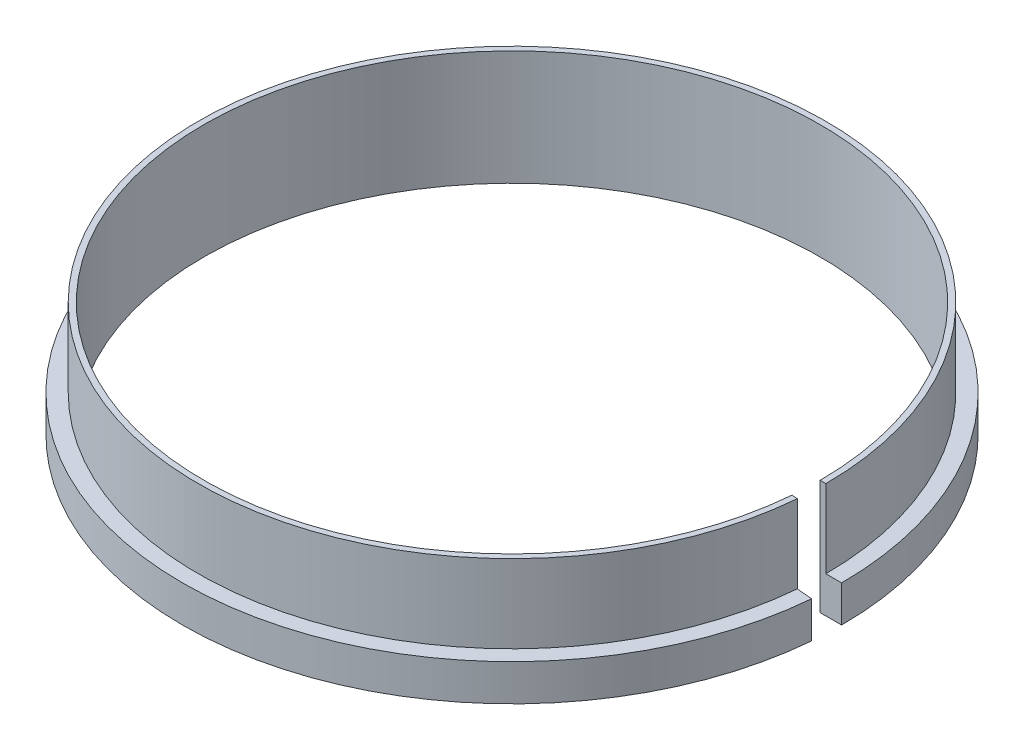
ISO-10303-21;
HEADER;
FILE_DESCRIPTION(('STEP AP214'),'2;1');
FILE_NAME('part.step','',(''),(''),'','','');
FILE_SCHEMA(('AUTOMOTIVE_DESIGN { 1 0 10303 214 1 1 1 1 }'));
ENDSEC;
DATA;
#1=APPLICATION_CONTEXT('core data for automotive mechanical design processes');
#2=APPLICATION_PROTOCOL_DEFINITION('international standard','automotive_design',2000,#1);
#3=PRODUCT_CONTEXT('',#1,'mechanical');
#4=PRODUCT('Part','Part','',(#3));
#5=PRODUCT_RELATED_PRODUCT_CATEGORY('part','',(#4));
#6=PRODUCT_DEFINITION_FORMATION('','',#4);
#7=PRODUCT_DEFINITION_CONTEXT('part definition',#1,'design');
#8=PRODUCT_DEFINITION('design','',#6,#7);
#9=PRODUCT_DEFINITION_SHAPE('','',#8);
#10=(LENGTH_UNIT() NAMED_UNIT(*) SI_UNIT(.MILLI.,.METRE.));
#11=(NAMED_UNIT(*) PLANE_ANGLE_UNIT() SI_UNIT($,.RADIAN.));
#12=(NAMED_UNIT(*) SI_UNIT($,.STERADIAN.) SOLID_ANGLE_UNIT());
#13=UNCERTAINTY_MEASURE_WITH_UNIT(LENGTH_MEASURE(1.E-05),#10,'distance_accuracy_value','');
#14=(GEOMETRIC_REPRESENTATION_CONTEXT(3) GLOBAL_UNCERTAINTY_ASSIGNED_CONTEXT((#13)) GLOBAL_UNIT_ASSIGNED_CONTEXT((#10,
#11,#12)) REPRESENTATION_CONTEXT('',''));
#15=CARTESIAN_POINT('',(0.,0.,0.));
#16=DIRECTION('',(0.,0.,1.));
#17=DIRECTION('',(1.,0.,0.));
#18=AXIS2_PLACEMENT_3D('',#15,#16,#17);
#19=CARTESIAN_POINT('',(22.9124780561102,0.,2.00458208319583));
#20=DIRECTION('',(0.,-1.,0.));
#21=DIRECTION('',(0.,0.,-1.));
#22=AXIS2_PLACEMENT_3D('',#19,#20,#21);
#23=PLANE('',#22);
#24=CARTESIAN_POINT('',(0.,0.,0.));
#25=DIRECTION('',(0.,-1.,0.));
#26=DIRECTION('',(0.,0.,-1.));
#27=AXIS2_PLACEMENT_3D('',#24,#25,#26);
#28=CIRCLE('',#27,21.5);
#29=CARTESIAN_POINT('',(21.4181860089726,0.,1.87384846907437));
#30=VERTEX_POINT('',#29);
#31=CARTESIAN_POINT('',(21.5,0.,0.));
#32=VERTEX_POINT('',#31);
#33=EDGE_CURVE('E13',#30,#32,#28,.T.);
#34=ORIENTED_EDGE('',*,*,#33,.F.);
#35=DIRECTION('',(0.996194698091749,0.,0.0871557427476454));
#36=VECTOR('',#35,1.);
#37=CARTESIAN_POINT('',(22.9124780561102,0.,2.00458208319583));
#38=LINE('',#37,#36);
#39=CARTESIAN_POINT('',(22.9124780561102,0.,2.00458208319583));
#40=VERTEX_POINT('',#39);
#41=EDGE_CURVE('E99',#30,#40,#38,.T.);
#42=ORIENTED_EDGE('',*,*,#41,.T.);
#43=CARTESIAN_POINT('',(0.,0.,0.));
#44=DIRECTION('',(0.,-1.,0.));
#45=DIRECTION('',(0.,0.,-1.));
#46=AXIS2_PLACEMENT_3D('',#43,#44,#45);
#47=CIRCLE('',#46,23.);
#48=CARTESIAN_POINT('',(23.,0.,0.));
#49=VERTEX_POINT('',#48);
#50=EDGE_CURVE('E94',#40,#49,#47,.T.);
#51=ORIENTED_EDGE('',*,*,#50,.T.);
#52=DIRECTION('',(1.,0.,0.));
#53=VECTOR('',#52,1.);
#54=CARTESIAN_POINT('',(23.,0.,0.));
#55=LINE('',#54,#53);
#56=EDGE_CURVE('E97',#32,#49,#55,.T.);
#57=ORIENTED_EDGE('',*,*,#56,.F.);
#58=EDGE_LOOP('',(#34,#42,#51,#57));
#59=FACE_BOUND('',#58,.T.);
#60=ADVANCED_FACE('F46',(#59),#23,.T.);
#61=CARTESIAN_POINT('',(0.,0.,0.));
#62=DIRECTION('',(0.,-1.,0.));
#63=DIRECTION('',(0.,0.,-1.));
#64=AXIS2_PLACEMENT_3D('',#61,#62,#63);
#65=CYLINDRICAL_SURFACE('',#64,21.5);
#66=CARTESIAN_POINT('',(0.,8.,0.));
#67=DIRECTION('',(0.,-1.,0.));
#68=DIRECTION('',(0.,0.,-1.));
#69=AXIS2_PLACEMENT_3D('',#66,#67,#68);
#70=CIRCLE('',#69,21.5);
#71=CARTESIAN_POINT('',(21.4181860089726,8.,1.87384846907437));
#72=VERTEX_POINT('',#71);
#73=CARTESIAN_POINT('',(21.5,8.,0.));
#74=VERTEX_POINT('',#73);
#75=EDGE_CURVE('E54',#72,#74,#70,.T.);
#76=ORIENTED_EDGE('',*,*,#75,.F.);
#77=DIRECTION('',(0.,-1.,0.));
#78=VECTOR('',#77,1.);
#79=CARTESIAN_POINT('',(21.4181860089726,0.,1.87384846907437));
#80=LINE('',#79,#78);
#81=EDGE_CURVE('E104',#72,#30,#80,.T.);
#82=ORIENTED_EDGE('',*,*,#81,.T.);
#83=ORIENTED_EDGE('',*,*,#33,.T.);
#84=DIRECTION('',(0.,-1.,0.));
#85=VECTOR('',#84,1.);
#86=CARTESIAN_POINT('',(21.5,0.,0.));
#87=LINE('',#86,#85);
#88=EDGE_CURVE('E117',#74,#32,#87,.T.);
#89=ORIENTED_EDGE('',*,*,#88,.F.);
#90=EDGE_LOOP('',(#76,#82,#83,#89));
#91=FACE_BOUND('',#90,.T.);
#92=ADVANCED_FACE('F48',(#91),#65,.F.);
#93=CARTESIAN_POINT('',(21.4181860089726,8.,1.87384846907437));
#94=DIRECTION('',(0.,1.,0.));
#95=DIRECTION('',(0.,0.,1.));
#96=AXIS2_PLACEMENT_3D('',#93,#94,#95);
#97=PLANE('',#96);
#98=CARTESIAN_POINT('',(0.,8.,0.));
#99=DIRECTION('',(0.,-1.,0.));
#100=DIRECTION('',(0.,0.,-1.));
#101=AXIS2_PLACEMENT_3D('',#98,#99,#100);
#102=CIRCLE('',#101,21.9);
#103=CARTESIAN_POINT('',(21.8166638882093,8.,1.90871076617341));
#104=VERTEX_POINT('',#103);
#105=CARTESIAN_POINT('',(21.9,8.,0.));
#106=VERTEX_POINT('',#105);
#107=EDGE_CURVE('E142',#104,#106,#102,.T.);
#108=ORIENTED_EDGE('',*,*,#107,.F.);
#109=DIRECTION('',(-0.996194698091749,0.,-0.0871557427476454));
#110=VECTOR('',#109,1.);
#111=CARTESIAN_POINT('',(21.4181860089726,8.,1.87384846907437));
#112=LINE('',#111,#110);
#113=EDGE_CURVE('E136',#104,#72,#112,.T.);
#114=ORIENTED_EDGE('',*,*,#113,.T.);
#115=ORIENTED_EDGE('',*,*,#75,.T.);
#116=DIRECTION('',(-1.,0.,0.));
#117=VECTOR('',#116,1.);
#118=CARTESIAN_POINT('',(21.5,8.,0.));
#119=LINE('',#118,#117);
#120=EDGE_CURVE('E124',#106,#74,#119,.T.);
#121=ORIENTED_EDGE('',*,*,#120,.F.);
#122=EDGE_LOOP('',(#108,#114,#115,#121));
#123=FACE_BOUND('',#122,.T.);
#124=ADVANCED_FACE('F145',(#123),#97,.T.);
#125=CARTESIAN_POINT('',(0.,0.,0.));
#126=DIRECTION('',(0.,-1.,0.));
#127=DIRECTION('',(0.,0.,-1.));
#128=AXIS2_PLACEMENT_3D('',#125,#126,#127);
#129=CYLINDRICAL_SURFACE('',#128,21.9);
#130=CARTESIAN_POINT('',(0.,2.55,0.));
#131=DIRECTION('',(0.,-1.,0.));
#132=DIRECTION('',(0.,0.,-1.));
#133=AXIS2_PLACEMENT_3D('',#130,#131,#132);
#134=CIRCLE('',#133,21.9);
#135=CARTESIAN_POINT('',(21.8166638882093,2.55,1.90871076617341));
#136=VERTEX_POINT('',#135);
#137=CARTESIAN_POINT('',(21.9,2.55,0.));
#138=VERTEX_POINT('',#137);
#139=EDGE_CURVE('E140',#136,#138,#134,.T.);
#140=ORIENTED_EDGE('',*,*,#139,.F.);
#141=DIRECTION('',(0.,1.,0.));
#142=VECTOR('',#141,1.);
#143=CARTESIAN_POINT('',(21.8166638882093,8.,1.90871076617341));
#144=LINE('',#143,#142);
#145=EDGE_CURVE('E133',#136,#104,#144,.T.);
#146=ORIENTED_EDGE('',*,*,#145,.T.);
#147=ORIENTED_EDGE('',*,*,#107,.T.);
#148=DIRECTION('',(0.,1.,0.));
#149=VECTOR('',#148,1.);
#150=CARTESIAN_POINT('',(21.9,8.,0.));
#151=LINE('',#150,#149);
#152=EDGE_CURVE('E121',#138,#106,#151,.T.);
#153=ORIENTED_EDGE('',*,*,#152,.F.);
#154=EDGE_LOOP('',(#140,#146,#147,#153));
#155=FACE_BOUND('',#154,.T.);
#156=ADVANCED_FACE('F156',(#155),#129,.T.);
#157=CARTESIAN_POINT('',(21.8166638882093,2.55,1.90871076617341));
#158=DIRECTION('',(0.,1.,0.));
#159=DIRECTION('',(0.,0.,1.));
#160=AXIS2_PLACEMENT_3D('',#157,#158,#159);
#161=PLANE('',#160);
#162=CARTESIAN_POINT('',(0.,2.55,0.));
#163=DIRECTION('',(0.,-1.,0.));
#164=DIRECTION('',(0.,0.,-1.));
#165=AXIS2_PLACEMENT_3D('',#162,#163,#164);
#166=CIRCLE('',#165,23.);
#167=CARTESIAN_POINT('',(22.9124780561102,2.55,2.00458208319583));
#168=VERTEX_POINT('',#167);
#169=CARTESIAN_POINT('',(23.,2.55,0.));
#170=VERTEX_POINT('',#169);
#171=EDGE_CURVE('E103',#168,#170,#166,.T.);
#172=ORIENTED_EDGE('',*,*,#171,.F.);
#173=DIRECTION('',(-0.996194698091749,0.,-0.0871557427476454));
#174=VECTOR('',#173,1.);
#175=CARTESIAN_POINT('',(21.8166638882093,2.55,1.90871076617341));
#176=LINE('',#175,#174);
#177=EDGE_CURVE('E130',#168,#136,#176,.T.);
#178=ORIENTED_EDGE('',*,*,#177,.T.);
#179=ORIENTED_EDGE('',*,*,#139,.T.);
#180=DIRECTION('',(-1.,0.,0.));
#181=VECTOR('',#180,1.);
#182=CARTESIAN_POINT('',(21.9,2.55,0.));
#183=LINE('',#182,#181);
#184=EDGE_CURVE('E112',#170,#138,#183,.T.);
#185=ORIENTED_EDGE('',*,*,#184,.F.);
#186=EDGE_LOOP('',(#172,#178,#179,#185));
#187=FACE_BOUND('',#186,.T.);
#188=ADVANCED_FACE('F154',(#187),#161,.T.);
#189=CARTESIAN_POINT('',(0.,0.,0.));
#190=DIRECTION('',(0.,-1.,0.));
#191=DIRECTION('',(0.,0.,-1.));
#192=AXIS2_PLACEMENT_3D('',#189,#190,#191);
#193=CYLINDRICAL_SURFACE('',#192,23.);
#194=DIRECTION('',(0.,1.,0.));
#195=VECTOR('',#194,1.);
#196=CARTESIAN_POINT('',(22.9124780561102,2.55,2.00458208319583));
#197=LINE('',#196,#195);
#198=EDGE_CURVE('E128',#40,#168,#197,.T.);
#199=ORIENTED_EDGE('',*,*,#198,.T.);
#200=ORIENTED_EDGE('',*,*,#171,.T.);
#201=DIRECTION('',(0.,1.,0.));
#202=VECTOR('',#201,1.);
#203=CARTESIAN_POINT('',(23.,2.55,0.));
#204=LINE('',#203,#202);
#205=EDGE_CURVE('E107',#49,#170,#204,.T.);
#206=ORIENTED_EDGE('',*,*,#205,.F.);
#207=ORIENTED_EDGE('',*,*,#50,.F.);
#208=EDGE_LOOP('',(#199,#200,#206,#207));
#209=FACE_BOUND('',#208,.T.);
#210=ADVANCED_FACE('F108',(#209),#193,.T.);
#211=CARTESIAN_POINT('',(0.,0.,0.));
#212=DIRECTION('',(0.0871557427476454,0.,-0.996194698091749));
#213=DIRECTION('',(-0.996194698091749,0.,-0.0871557427476454));
#214=AXIS2_PLACEMENT_3D('',#211,#212,#213);
#215=PLANE('',#214);
#216=ORIENTED_EDGE('',*,*,#41,.F.);
#217=ORIENTED_EDGE('',*,*,#81,.F.);
#218=ORIENTED_EDGE('',*,*,#113,.F.);
#219=ORIENTED_EDGE('',*,*,#145,.F.);
#220=ORIENTED_EDGE('',*,*,#177,.F.);
#221=ORIENTED_EDGE('',*,*,#198,.F.);
#222=EDGE_LOOP('',(#216,#217,#218,#219,#220,#221));
#223=FACE_BOUND('',#222,.T.);
#224=ADVANCED_FACE('F150',(#223),#215,.T.);
#225=CARTESIAN_POINT('',(0.,0.,0.));
#226=DIRECTION('',(0.,0.,-1.));
#227=DIRECTION('',(-1.,0.,0.));
#228=AXIS2_PLACEMENT_3D('',#225,#226,#227);
#229=PLANE('',#228);
#230=ORIENTED_EDGE('',*,*,#56,.T.);
#231=ORIENTED_EDGE('',*,*,#205,.T.);
#232=ORIENTED_EDGE('',*,*,#184,.T.);
#233=ORIENTED_EDGE('',*,*,#152,.T.);
#234=ORIENTED_EDGE('',*,*,#120,.T.);
#235=ORIENTED_EDGE('',*,*,#88,.T.);
#236=EDGE_LOOP('',(#230,#231,#232,#233,#234,#235));
#237=FACE_BOUND('',#236,.T.);
#238=ADVANCED_FACE('F115',(#237),#229,.F.);
#239=CLOSED_SHELL('',(#60,#92,#124,#156,#188,#210,#224,#238));
#240=MANIFOLD_SOLID_BREP('B2',#239);
#241=ADVANCED_BREP_SHAPE_REPRESENTATION('',(#18,#240),#14);
#242=SHAPE_DEFINITION_REPRESENTATION(#9,#241);
ENDSEC;
END-ISO-10303-21;
